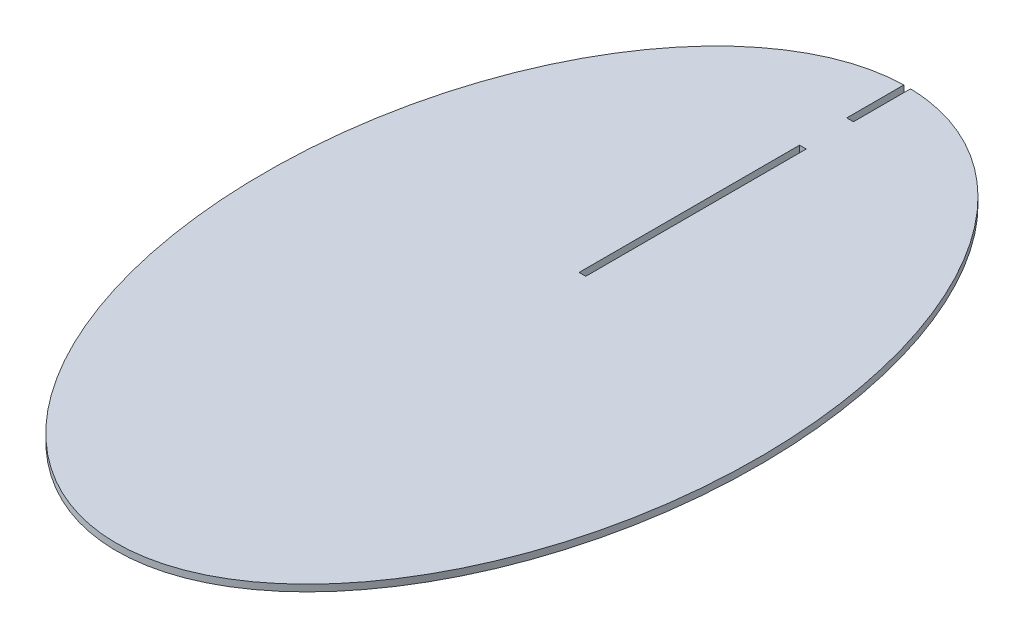
ISO-10303-21;
HEADER;
FILE_DESCRIPTION(('STEP AP214'),'2;1');
FILE_NAME('part.step','',(''),(''),'','','');
FILE_SCHEMA(('AUTOMOTIVE_DESIGN { 1 0 10303 214 1 1 1 1 }'));
ENDSEC;
DATA;
#1=APPLICATION_CONTEXT('core data for automotive mechanical design processes');
#2=APPLICATION_PROTOCOL_DEFINITION('international standard','automotive_design',2000,#1);
#3=PRODUCT_CONTEXT('',#1,'mechanical');
#4=PRODUCT('Part','Part','',(#3));
#5=PRODUCT_RELATED_PRODUCT_CATEGORY('part','',(#4));
#6=PRODUCT_DEFINITION_FORMATION('','',#4);
#7=PRODUCT_DEFINITION_CONTEXT('part definition',#1,'design');
#8=PRODUCT_DEFINITION('design','',#6,#7);
#9=PRODUCT_DEFINITION_SHAPE('','',#8);
#10=(LENGTH_UNIT() NAMED_UNIT(*) SI_UNIT(.MILLI.,.METRE.));
#11=(NAMED_UNIT(*) PLANE_ANGLE_UNIT() SI_UNIT($,.RADIAN.));
#12=(NAMED_UNIT(*) SI_UNIT($,.STERADIAN.) SOLID_ANGLE_UNIT());
#13=UNCERTAINTY_MEASURE_WITH_UNIT(LENGTH_MEASURE(1.E-05),#10,'distance_accuracy_value','');
#14=(GEOMETRIC_REPRESENTATION_CONTEXT(3) GLOBAL_UNCERTAINTY_ASSIGNED_CONTEXT((#13)) GLOBAL_UNIT_ASSIGNED_CONTEXT((#10,
#11,#12)) REPRESENTATION_CONTEXT('',''));
#15=CARTESIAN_POINT('',(0.,0.,0.));
#16=DIRECTION('',(0.,0.,1.));
#17=DIRECTION('',(1.,0.,0.));
#18=AXIS2_PLACEMENT_3D('',#15,#16,#17);
#19=CARTESIAN_POINT('',(0.,1.524,0.));
#20=DIRECTION('',(0.,1.,0.));
#21=DIRECTION('',(0.,0.,1.));
#22=AXIS2_PLACEMENT_3D('',#19,#20,#21);
#23=PLANE('',#22);
#24=DIRECTION('',(-1.,0.,0.));
#25=VECTOR('',#24,1.);
#26=CARTESIAN_POINT('',(-0.762,1.524,-77.0678499345602));
#27=LINE('',#26,#25);
#28=CARTESIAN_POINT('',(0.762,1.524,-77.0678499345602));
#29=VERTEX_POINT('',#28);
#30=CARTESIAN_POINT('',(-0.762,1.524,-77.0678499345602));
#31=VERTEX_POINT('',#30);
#32=EDGE_CURVE('E133',#29,#31,#27,.T.);
#33=ORIENTED_EDGE('',*,*,#32,.T.);
#34=DIRECTION('',(0.,0.,-1.));
#35=VECTOR('',#34,1.);
#36=CARTESIAN_POINT('',(-0.762,1.524,-90.084468739508));
#37=LINE('',#36,#35);
#38=CARTESIAN_POINT('',(-0.762,1.524,-90.084468739508));
#39=VERTEX_POINT('',#38);
#40=EDGE_CURVE('E136',#31,#39,#37,.T.);
#41=ORIENTED_EDGE('',*,*,#40,.T.);
#42=CARTESIAN_POINT('',(0.,1.524,0.));
#43=DIRECTION('',(0.,1.,0.));
#44=DIRECTION('',(0.,0.,-1.));
#45=AXIS2_PLACEMENT_3D('',#42,#43,#44);
#46=ELLIPSE('',#45,90.092730028974,56.2692185087309);
#47=CARTESIAN_POINT('',(0.76200000000002,1.524,-90.084468739508));
#48=VERTEX_POINT('',#47);
#49=EDGE_CURVE('E139',#39,#48,#46,.T.);
#50=ORIENTED_EDGE('',*,*,#49,.T.);
#51=DIRECTION('',(0.,0.,1.));
#52=VECTOR('',#51,1.);
#53=CARTESIAN_POINT('',(0.762,1.524,-90.084468739508));
#54=LINE('',#53,#52);
#55=EDGE_CURVE('E142',#48,#29,#54,.T.);
#56=ORIENTED_EDGE('',*,*,#55,.T.);
#57=EDGE_LOOP('',(#33,#41,#50,#56));
#58=FACE_BOUND('',#57,.T.);
#59=DIRECTION('',(0.,0.,1.));
#60=VECTOR('',#59,1.);
#61=CARTESIAN_POINT('',(-0.762,1.524,-66.3202208914947));
#62=LINE('',#61,#60);
#63=CARTESIAN_POINT('',(-0.762,1.524,-66.3202208914947));
#64=VERTEX_POINT('',#63);
#65=CARTESIAN_POINT('',(-0.762,1.524,-16.0748253616449));
#66=VERTEX_POINT('',#65);
#67=EDGE_CURVE('E105',#64,#66,#62,.T.);
#68=ORIENTED_EDGE('',*,*,#67,.F.);
#69=DIRECTION('',(-1.,0.,0.));
#70=VECTOR('',#69,1.);
#71=CARTESIAN_POINT('',(-0.762,1.524,-66.3202208914947));
#72=LINE('',#71,#70);
#73=CARTESIAN_POINT('',(0.762,1.524,-66.3202208914947));
#74=VERTEX_POINT('',#73);
#75=EDGE_CURVE('E97',#74,#64,#72,.T.);
#76=ORIENTED_EDGE('',*,*,#75,.F.);
#77=DIRECTION('',(0.,0.,-1.));
#78=VECTOR('',#77,1.);
#79=CARTESIAN_POINT('',(0.762,1.524,-66.3202208914947));
#80=LINE('',#79,#78);
#81=CARTESIAN_POINT('',(0.762,1.524,-16.0748253616449));
#82=VERTEX_POINT('',#81);
#83=EDGE_CURVE('E119',#82,#74,#80,.T.);
#84=ORIENTED_EDGE('',*,*,#83,.F.);
#85=DIRECTION('',(1.,0.,0.));
#86=VECTOR('',#85,1.);
#87=CARTESIAN_POINT('',(-0.762,1.524,-16.0748253616449));
#88=LINE('',#87,#86);
#89=EDGE_CURVE('E117',#66,#82,#88,.T.);
#90=ORIENTED_EDGE('',*,*,#89,.F.);
#91=EDGE_LOOP('',(#68,#76,#84,#90));
#92=FACE_BOUND('',#91,.T.);
#93=ADVANCED_FACE('F32',(#58,#92),#23,.T.);
#94=CARTESIAN_POINT('',(0.,0.,0.));
#95=DIRECTION('',(0.,1.,0.));
#96=DIRECTION('',(0.,0.,1.));
#97=AXIS2_PLACEMENT_3D('',#94,#95,#96);
#98=PLANE('',#97);
#99=DIRECTION('',(-1.,0.,0.));
#100=VECTOR('',#99,1.);
#101=CARTESIAN_POINT('',(-0.762,0.,-77.0678499345602));
#102=LINE('',#101,#100);
#103=CARTESIAN_POINT('',(0.762,0.,-77.0678499345602));
#104=VERTEX_POINT('',#103);
#105=CARTESIAN_POINT('',(-0.762,0.,-77.0678499345602));
#106=VERTEX_POINT('',#105);
#107=EDGE_CURVE('E113',#104,#106,#102,.T.);
#108=ORIENTED_EDGE('',*,*,#107,.F.);
#109=DIRECTION('',(0.,0.,1.));
#110=VECTOR('',#109,1.);
#111=CARTESIAN_POINT('',(0.762,0.,-90.084468739508));
#112=LINE('',#111,#110);
#113=CARTESIAN_POINT('',(0.76200000000002,0.,-90.084468739508));
#114=VERTEX_POINT('',#113);
#115=EDGE_CURVE('E137',#114,#104,#112,.T.);
#116=ORIENTED_EDGE('',*,*,#115,.F.);
#117=CARTESIAN_POINT('',(0.,0.,0.));
#118=DIRECTION('',(0.,1.,0.));
#119=DIRECTION('',(0.,0.,-1.));
#120=AXIS2_PLACEMENT_3D('',#117,#118,#119);
#121=ELLIPSE('',#120,90.092730028974,56.2692185087309);
#122=CARTESIAN_POINT('',(-0.762,0.,-90.084468739508));
#123=VERTEX_POINT('',#122);
#124=EDGE_CURVE('E248',#123,#114,#121,.T.);
#125=ORIENTED_EDGE('',*,*,#124,.F.);
#126=DIRECTION('',(0.,0.,-1.));
#127=VECTOR('',#126,1.);
#128=CARTESIAN_POINT('',(-0.762,0.,-90.084468739508));
#129=LINE('',#128,#127);
#130=EDGE_CURVE('E253',#106,#123,#129,.T.);
#131=ORIENTED_EDGE('',*,*,#130,.F.);
#132=EDGE_LOOP('',(#108,#116,#125,#131));
#133=FACE_BOUND('',#132,.T.);
#134=DIRECTION('',(-1.,0.,0.));
#135=VECTOR('',#134,1.);
#136=CARTESIAN_POINT('',(-0.762,0.,-66.3202208914947));
#137=LINE('',#136,#135);
#138=CARTESIAN_POINT('',(0.762,0.,-66.3202208914947));
#139=VERTEX_POINT('',#138);
#140=CARTESIAN_POINT('',(-0.762,0.,-66.3202208914947));
#141=VERTEX_POINT('',#140);
#142=EDGE_CURVE('E55',#139,#141,#137,.T.);
#143=ORIENTED_EDGE('',*,*,#142,.T.);
#144=DIRECTION('',(0.,0.,1.));
#145=VECTOR('',#144,1.);
#146=CARTESIAN_POINT('',(-0.762,0.,-66.3202208914947));
#147=LINE('',#146,#145);
#148=CARTESIAN_POINT('',(-0.762,0.,-16.0748253616449));
#149=VERTEX_POINT('',#148);
#150=EDGE_CURVE('E112',#141,#149,#147,.T.);
#151=ORIENTED_EDGE('',*,*,#150,.T.);
#152=DIRECTION('',(1.,0.,0.));
#153=VECTOR('',#152,1.);
#154=CARTESIAN_POINT('',(-0.762,0.,-16.0748253616449));
#155=LINE('',#154,#153);
#156=CARTESIAN_POINT('',(0.762,0.,-16.0748253616449));
#157=VERTEX_POINT('',#156);
#158=EDGE_CURVE('E125',#149,#157,#155,.T.);
#159=ORIENTED_EDGE('',*,*,#158,.T.);
#160=DIRECTION('',(0.,0.,-1.));
#161=VECTOR('',#160,1.);
#162=CARTESIAN_POINT('',(0.762,0.,-66.3202208914947));
#163=LINE('',#162,#161);
#164=EDGE_CURVE('E106',#157,#139,#163,.T.);
#165=ORIENTED_EDGE('',*,*,#164,.T.);
#166=EDGE_LOOP('',(#143,#151,#159,#165));
#167=FACE_BOUND('',#166,.T.);
#168=ADVANCED_FACE('F157',(#133,#167),#98,.F.);
#169=CARTESIAN_POINT('',(-0.762,1.524,-77.0678499345602));
#170=DIRECTION('',(0.,0.,1.));
#171=DIRECTION('',(1.,0.,0.));
#172=AXIS2_PLACEMENT_3D('',#169,#170,#171);
#173=PLANE('',#172);
#174=ORIENTED_EDGE('',*,*,#107,.T.);
#175=DIRECTION('',(0.,-1.,0.));
#176=VECTOR('',#175,1.);
#177=CARTESIAN_POINT('',(-0.762,1.524,-77.0678499345602));
#178=LINE('',#177,#176);
#179=EDGE_CURVE('E11',#31,#106,#178,.T.);
#180=ORIENTED_EDGE('',*,*,#179,.F.);
#181=ORIENTED_EDGE('',*,*,#32,.F.);
#182=DIRECTION('',(0.,-1.,0.));
#183=VECTOR('',#182,1.);
#184=CARTESIAN_POINT('',(0.762,1.524,-77.0678499345602));
#185=LINE('',#184,#183);
#186=EDGE_CURVE('E242',#29,#104,#185,.T.);
#187=ORIENTED_EDGE('',*,*,#186,.T.);
#188=EDGE_LOOP('',(#174,#180,#181,#187));
#189=FACE_BOUND('',#188,.T.);
#190=ADVANCED_FACE('F34',(#189),#173,.F.);
#191=CARTESIAN_POINT('',(-0.762,1.524,-90.084468739508));
#192=DIRECTION('',(-1.,0.,0.));
#193=DIRECTION('',(0.,0.,1.));
#194=AXIS2_PLACEMENT_3D('',#191,#192,#193);
#195=PLANE('',#194);
#196=ORIENTED_EDGE('',*,*,#130,.T.);
#197=DIRECTION('',(0.,-1.,0.));
#198=VECTOR('',#197,1.);
#199=CARTESIAN_POINT('',(-0.762,1.524,-90.084468739508));
#200=LINE('',#199,#198);
#201=EDGE_CURVE('E40',#39,#123,#200,.T.);
#202=ORIENTED_EDGE('',*,*,#201,.F.);
#203=ORIENTED_EDGE('',*,*,#40,.F.);
#204=ORIENTED_EDGE('',*,*,#179,.T.);
#205=EDGE_LOOP('',(#196,#202,#203,#204));
#206=FACE_BOUND('',#205,.T.);
#207=ADVANCED_FACE('F149',(#206),#195,.F.);
#208=DIRECTION('',(0.,-1.,0.));
#209=VECTOR('',#208,1.);
#210=SURFACE_OF_LINEAR_EXTRUSION('',#46,#209);
#211=ORIENTED_EDGE('',*,*,#124,.T.);
#212=DIRECTION('',(0.,-1.,0.));
#213=VECTOR('',#212,1.);
#214=CARTESIAN_POINT('',(0.76200000000002,1.524,-90.084468739508));
#215=LINE('',#214,#213);
#216=EDGE_CURVE('E245',#48,#114,#215,.T.);
#217=ORIENTED_EDGE('',*,*,#216,.F.);
#218=ORIENTED_EDGE('',*,*,#49,.F.);
#219=ORIENTED_EDGE('',*,*,#201,.T.);
#220=EDGE_LOOP('',(#211,#217,#218,#219));
#221=FACE_BOUND('',#220,.T.);
#222=ADVANCED_FACE('F145',(#221),#210,.F.);
#223=CARTESIAN_POINT('',(0.762,1.524,-90.084468739508));
#224=DIRECTION('',(1.,0.,0.));
#225=DIRECTION('',(0.,0.,-1.));
#226=AXIS2_PLACEMENT_3D('',#223,#224,#225);
#227=PLANE('',#226);
#228=ORIENTED_EDGE('',*,*,#115,.T.);
#229=ORIENTED_EDGE('',*,*,#186,.F.);
#230=ORIENTED_EDGE('',*,*,#55,.F.);
#231=ORIENTED_EDGE('',*,*,#216,.T.);
#232=EDGE_LOOP('',(#228,#229,#230,#231));
#233=FACE_BOUND('',#232,.T.);
#234=ADVANCED_FACE('F148',(#233),#227,.F.);
#235=CARTESIAN_POINT('',(-0.762,1.524,-66.3202208914947));
#236=DIRECTION('',(0.,0.,1.));
#237=DIRECTION('',(1.,0.,0.));
#238=AXIS2_PLACEMENT_3D('',#235,#236,#237);
#239=PLANE('',#238);
#240=ORIENTED_EDGE('',*,*,#142,.F.);
#241=DIRECTION('',(0.,-1.,0.));
#242=VECTOR('',#241,1.);
#243=CARTESIAN_POINT('',(0.762,1.524,-66.3202208914947));
#244=LINE('',#243,#242);
#245=EDGE_CURVE('E101',#74,#139,#244,.T.);
#246=ORIENTED_EDGE('',*,*,#245,.F.);
#247=ORIENTED_EDGE('',*,*,#75,.T.);
#248=DIRECTION('',(0.,-1.,0.));
#249=VECTOR('',#248,1.);
#250=CARTESIAN_POINT('',(-0.762,1.524,-66.3202208914947));
#251=LINE('',#250,#249);
#252=EDGE_CURVE('E100',#64,#141,#251,.T.);
#253=ORIENTED_EDGE('',*,*,#252,.T.);
#254=EDGE_LOOP('',(#240,#246,#247,#253));
#255=FACE_BOUND('',#254,.T.);
#256=ADVANCED_FACE('F99',(#255),#239,.T.);
#257=CARTESIAN_POINT('',(-0.762,1.524,-66.3202208914947));
#258=DIRECTION('',(1.,0.,0.));
#259=DIRECTION('',(0.,0.,-1.));
#260=AXIS2_PLACEMENT_3D('',#257,#258,#259);
#261=PLANE('',#260);
#262=ORIENTED_EDGE('',*,*,#150,.F.);
#263=ORIENTED_EDGE('',*,*,#252,.F.);
#264=ORIENTED_EDGE('',*,*,#67,.T.);
#265=DIRECTION('',(0.,-1.,0.));
#266=VECTOR('',#265,1.);
#267=CARTESIAN_POINT('',(-0.762,1.524,-16.0748253616449));
#268=LINE('',#267,#266);
#269=EDGE_CURVE('E114',#66,#149,#268,.T.);
#270=ORIENTED_EDGE('',*,*,#269,.T.);
#271=EDGE_LOOP('',(#262,#263,#264,#270));
#272=FACE_BOUND('',#271,.T.);
#273=ADVANCED_FACE('F109',(#272),#261,.T.);
#274=CARTESIAN_POINT('',(-0.762,1.524,-16.0748253616449));
#275=DIRECTION('',(0.,0.,-1.));
#276=DIRECTION('',(-1.,0.,0.));
#277=AXIS2_PLACEMENT_3D('',#274,#275,#276);
#278=PLANE('',#277);
#279=ORIENTED_EDGE('',*,*,#158,.F.);
#280=ORIENTED_EDGE('',*,*,#269,.F.);
#281=ORIENTED_EDGE('',*,*,#89,.T.);
#282=DIRECTION('',(0.,-1.,0.));
#283=VECTOR('',#282,1.);
#284=CARTESIAN_POINT('',(0.762,1.524,-16.0748253616449));
#285=LINE('',#284,#283);
#286=EDGE_CURVE('E47',#82,#157,#285,.T.);
#287=ORIENTED_EDGE('',*,*,#286,.T.);
#288=EDGE_LOOP('',(#279,#280,#281,#287));
#289=FACE_BOUND('',#288,.T.);
#290=ADVANCED_FACE('F171',(#289),#278,.T.);
#291=CARTESIAN_POINT('',(0.762,1.524,-66.3202208914947));
#292=DIRECTION('',(-1.,0.,0.));
#293=DIRECTION('',(0.,0.,1.));
#294=AXIS2_PLACEMENT_3D('',#291,#292,#293);
#295=PLANE('',#294);
#296=ORIENTED_EDGE('',*,*,#164,.F.);
#297=ORIENTED_EDGE('',*,*,#286,.F.);
#298=ORIENTED_EDGE('',*,*,#83,.T.);
#299=ORIENTED_EDGE('',*,*,#245,.T.);
#300=EDGE_LOOP('',(#296,#297,#298,#299));
#301=FACE_BOUND('',#300,.T.);
#302=ADVANCED_FACE('F174',(#301),#295,.T.);
#303=CLOSED_SHELL('',(#93,#168,#190,#207,#222,#234,#256,#273,#290,#302));
#304=MANIFOLD_SOLID_BREP('B2',#303);
#305=ADVANCED_BREP_SHAPE_REPRESENTATION('',(#18,#304),#14);
#306=SHAPE_DEFINITION_REPRESENTATION(#9,#305);
ENDSEC;
END-ISO-10303-21;
